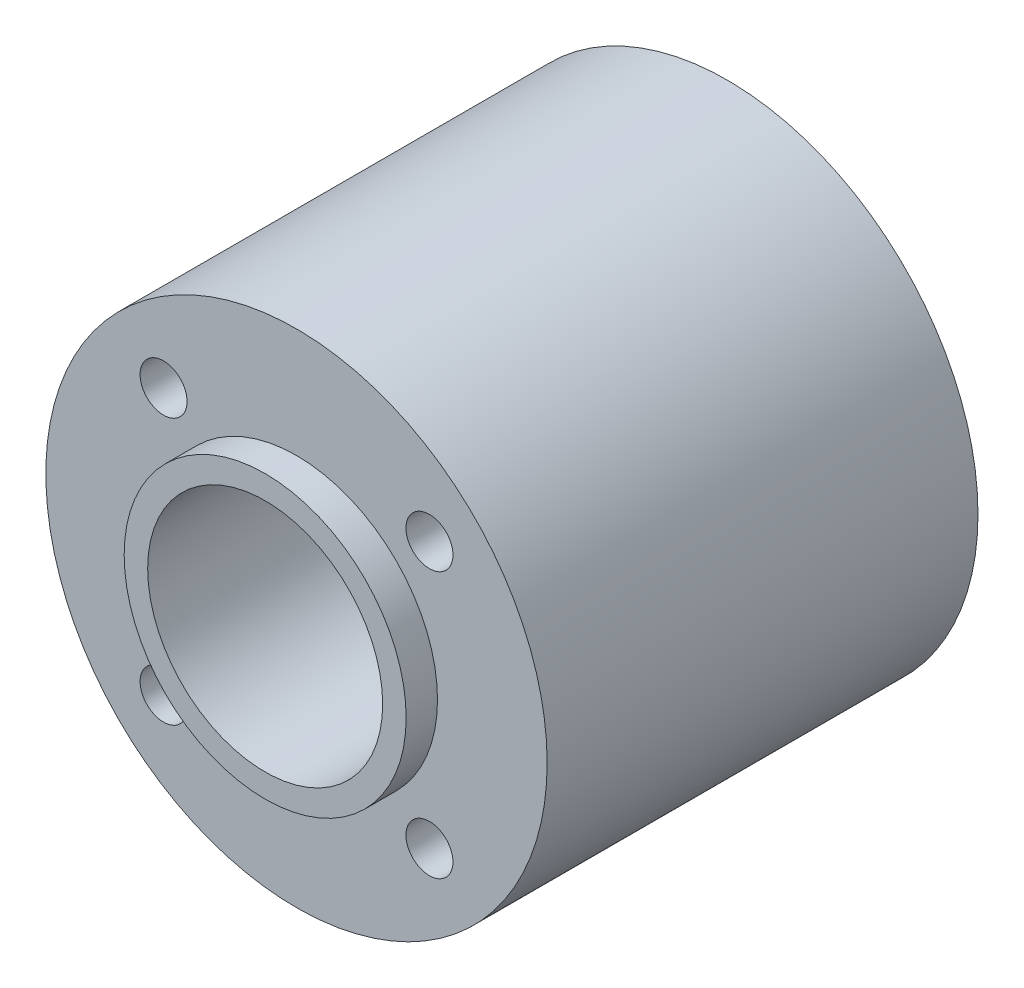
ISO-10303-21;
HEADER;
FILE_DESCRIPTION(('STEP AP214'),'2;1');
FILE_NAME('part.step','',(''),(''),'','','');
FILE_SCHEMA(('AUTOMOTIVE_DESIGN { 1 0 10303 214 1 1 1 1 }'));
ENDSEC;
DATA;
#1=APPLICATION_CONTEXT('core data for automotive mechanical design processes');
#2=APPLICATION_PROTOCOL_DEFINITION('international standard','automotive_design',2000,#1);
#3=PRODUCT_CONTEXT('',#1,'mechanical');
#4=PRODUCT('Part','Part','',(#3));
#5=PRODUCT_RELATED_PRODUCT_CATEGORY('part','',(#4));
#6=PRODUCT_DEFINITION_FORMATION('','',#4);
#7=PRODUCT_DEFINITION_CONTEXT('part definition',#1,'design');
#8=PRODUCT_DEFINITION('design','',#6,#7);
#9=PRODUCT_DEFINITION_SHAPE('','',#8);
#10=(LENGTH_UNIT() NAMED_UNIT(*) SI_UNIT(.MILLI.,.METRE.));
#11=(NAMED_UNIT(*) PLANE_ANGLE_UNIT() SI_UNIT($,.RADIAN.));
#12=(NAMED_UNIT(*) SI_UNIT($,.STERADIAN.) SOLID_ANGLE_UNIT());
#13=UNCERTAINTY_MEASURE_WITH_UNIT(LENGTH_MEASURE(1.E-05),#10,'distance_accuracy_value','');
#14=(GEOMETRIC_REPRESENTATION_CONTEXT(3) GLOBAL_UNCERTAINTY_ASSIGNED_CONTEXT((#13)) GLOBAL_UNIT_ASSIGNED_CONTEXT((#10,
#11,#12)) REPRESENTATION_CONTEXT('',''));
#15=CARTESIAN_POINT('',(0.,0.,0.));
#16=DIRECTION('',(0.,0.,1.));
#17=DIRECTION('',(1.,0.,0.));
#18=AXIS2_PLACEMENT_3D('',#15,#16,#17);
#19=CARTESIAN_POINT('',(0.,0.,-36.67125));
#20=DIRECTION('',(0.,0.,1.));
#21=DIRECTION('',(1.,0.,0.));
#22=AXIS2_PLACEMENT_3D('',#19,#20,#21);
#23=CYLINDRICAL_SURFACE('',#22,26.672);
#24=CARTESIAN_POINT('',(0.,0.,-36.67125));
#25=DIRECTION('',(0.,0.,1.));
#26=DIRECTION('',(1.,0.,0.));
#27=AXIS2_PLACEMENT_3D('',#24,#25,#26);
#28=CIRCLE('',#27,26.672);
#29=CARTESIAN_POINT('',(26.672,0.,-36.67125));
#30=VERTEX_POINT('',#29);
#31=EDGE_CURVE('E11',#30,#30,#28,.T.);
#32=ORIENTED_EDGE('',*,*,#31,.T.);
#33=EDGE_LOOP('',(#32));
#34=FACE_BOUND('',#33,.T.);
#35=CARTESIAN_POINT('',(0.,0.,9.17125));
#36=DIRECTION('',(0.,0.,1.));
#37=DIRECTION('',(1.,0.,0.));
#38=AXIS2_PLACEMENT_3D('',#35,#36,#37);
#39=CIRCLE('',#38,26.672);
#40=CARTESIAN_POINT('',(26.672,0.,9.17125));
#41=VERTEX_POINT('',#40);
#42=EDGE_CURVE('E48',#41,#41,#39,.T.);
#43=ORIENTED_EDGE('',*,*,#42,.F.);
#44=EDGE_LOOP('',(#43));
#45=FACE_BOUND('',#44,.T.);
#46=ADVANCED_FACE('F45',(#34,#45),#23,.T.);
#47=CARTESIAN_POINT('',(0.,0.,-36.67125));
#48=DIRECTION('',(0.,0.,1.));
#49=DIRECTION('',(1.,0.,0.));
#50=AXIS2_PLACEMENT_3D('',#47,#48,#49);
#51=CYLINDRICAL_SURFACE('',#50,12.5025);
#52=CARTESIAN_POINT('',(0.,0.,12.50525));
#53=DIRECTION('',(0.,0.,1.));
#54=DIRECTION('',(1.,0.,0.));
#55=AXIS2_PLACEMENT_3D('',#52,#53,#54);
#56=CIRCLE('',#55,12.5025);
#57=CARTESIAN_POINT('',(12.5025,0.,12.50525));
#58=VERTEX_POINT('',#57);
#59=EDGE_CURVE('E63',#58,#58,#56,.T.);
#60=ORIENTED_EDGE('',*,*,#59,.T.);
#61=EDGE_LOOP('',(#60));
#62=FACE_BOUND('',#61,.T.);
#63=CARTESIAN_POINT('',(0.,0.,-40.00525));
#64=DIRECTION('',(0.,0.,1.));
#65=DIRECTION('',(1.,0.,0.));
#66=AXIS2_PLACEMENT_3D('',#63,#64,#65);
#67=CIRCLE('',#66,12.5025);
#68=CARTESIAN_POINT('',(12.5025,0.,-40.00525));
#69=VERTEX_POINT('',#68);
#70=EDGE_CURVE('E107',#69,#69,#67,.T.);
#71=ORIENTED_EDGE('',*,*,#70,.F.);
#72=EDGE_LOOP('',(#71));
#73=FACE_BOUND('',#72,.T.);
#74=ADVANCED_FACE('F118',(#62,#73),#51,.F.);
#75=CARTESIAN_POINT('',(0.,0.,-36.67125));
#76=DIRECTION('',(0.,0.,1.));
#77=DIRECTION('',(1.,0.,0.));
#78=AXIS2_PLACEMENT_3D('',#75,#76,#77);
#79=PLANE('',#78);
#80=CARTESIAN_POINT('',(0.,0.,-36.67125));
#81=DIRECTION('',(0.,0.,1.));
#82=DIRECTION('',(1.,0.,0.));
#83=AXIS2_PLACEMENT_3D('',#80,#81,#82);
#84=CIRCLE('',#83,15.003);
#85=CARTESIAN_POINT('',(15.003,0.,-36.67125));
#86=VERTEX_POINT('',#85);
#87=EDGE_CURVE('E103',#86,#86,#84,.T.);
#88=ORIENTED_EDGE('',*,*,#87,.T.);
#89=EDGE_LOOP('',(#88));
#90=FACE_BOUND('',#89,.T.);
#91=CARTESIAN_POINT('',(-14.1449640508557,-14.1449640508557,-36.67125));
#92=DIRECTION('',(0.,0.,1.));
#93=DIRECTION('',(1.,0.,0.));
#94=AXIS2_PLACEMENT_3D('',#91,#92,#93);
#95=CIRCLE('',#94,2.50050000000019);
#96=CARTESIAN_POINT('',(-11.6444640508555,-14.1449640508557,-36.67125));
#97=VERTEX_POINT('',#96);
#98=EDGE_CURVE('E64',#97,#97,#95,.T.);
#99=ORIENTED_EDGE('',*,*,#98,.T.);
#100=EDGE_LOOP('',(#99));
#101=FACE_BOUND('',#100,.T.);
#102=CARTESIAN_POINT('',(14.1449640508557,-14.1449640508557,-36.67125));
#103=DIRECTION('',(0.,0.,1.));
#104=DIRECTION('',(1.,0.,0.));
#105=AXIS2_PLACEMENT_3D('',#102,#103,#104);
#106=CIRCLE('',#105,2.50050000000013);
#107=CARTESIAN_POINT('',(16.6454640508558,-14.1449640508557,-36.67125));
#108=VERTEX_POINT('',#107);
#109=EDGE_CURVE('E74',#108,#108,#106,.T.);
#110=ORIENTED_EDGE('',*,*,#109,.T.);
#111=EDGE_LOOP('',(#110));
#112=FACE_BOUND('',#111,.T.);
#113=CARTESIAN_POINT('',(14.1449640508557,14.1449640508557,-36.67125));
#114=DIRECTION('',(0.,0.,1.));
#115=DIRECTION('',(1.,0.,0.));
#116=AXIS2_PLACEMENT_3D('',#113,#114,#115);
#117=CIRCLE('',#116,2.50050000000006);
#118=CARTESIAN_POINT('',(16.6454640508558,14.1449640508557,-36.67125));
#119=VERTEX_POINT('',#118);
#120=EDGE_CURVE('E78',#119,#119,#117,.T.);
#121=ORIENTED_EDGE('',*,*,#120,.T.);
#122=EDGE_LOOP('',(#121));
#123=FACE_BOUND('',#122,.T.);
#124=CARTESIAN_POINT('',(-14.1449640508557,14.1449640508557,-36.67125));
#125=DIRECTION('',(0.,0.,1.));
#126=DIRECTION('',(1.,0.,0.));
#127=AXIS2_PLACEMENT_3D('',#124,#125,#126);
#128=CIRCLE('',#127,2.5005);
#129=CARTESIAN_POINT('',(-11.6444640508557,14.1449640508557,-36.67125));
#130=VERTEX_POINT('',#129);
#131=EDGE_CURVE('E82',#130,#130,#128,.T.);
#132=ORIENTED_EDGE('',*,*,#131,.T.);
#133=EDGE_LOOP('',(#132));
#134=FACE_BOUND('',#133,.T.);
#135=ORIENTED_EDGE('',*,*,#31,.F.);
#136=EDGE_LOOP('',(#135));
#137=FACE_BOUND('',#136,.T.);
#138=ADVANCED_FACE('F120',(#90,#101,#112,#123,#134,#137),#79,.F.);
#139=CARTESIAN_POINT('',(0.,0.,9.17125));
#140=DIRECTION('',(0.,0.,1.));
#141=DIRECTION('',(1.,0.,0.));
#142=AXIS2_PLACEMENT_3D('',#139,#140,#141);
#143=PLANE('',#142);
#144=CARTESIAN_POINT('',(-14.1449640508557,-14.1449640508557,9.17125));
#145=DIRECTION('',(0.,0.,1.));
#146=DIRECTION('',(1.,0.,0.));
#147=AXIS2_PLACEMENT_3D('',#144,#145,#146);
#148=CIRCLE('',#147,2.50050000000019);
#149=CARTESIAN_POINT('',(-11.6444640508555,-14.1449640508557,9.17125));
#150=VERTEX_POINT('',#149);
#151=EDGE_CURVE('E91',#150,#150,#148,.T.);
#152=ORIENTED_EDGE('',*,*,#151,.F.);
#153=EDGE_LOOP('',(#152));
#154=FACE_BOUND('',#153,.T.);
#155=CARTESIAN_POINT('',(14.1449640508557,-14.1449640508557,9.17125));
#156=DIRECTION('',(0.,0.,1.));
#157=DIRECTION('',(1.,0.,0.));
#158=AXIS2_PLACEMENT_3D('',#155,#156,#157);
#159=CIRCLE('',#158,2.50050000000013);
#160=CARTESIAN_POINT('',(16.6454640508558,-14.1449640508557,9.17125));
#161=VERTEX_POINT('',#160);
#162=EDGE_CURVE('E95',#161,#161,#159,.T.);
#163=ORIENTED_EDGE('',*,*,#162,.F.);
#164=EDGE_LOOP('',(#163));
#165=FACE_BOUND('',#164,.T.);
#166=CARTESIAN_POINT('',(14.1449640508557,14.1449640508557,9.17125));
#167=DIRECTION('',(0.,0.,1.));
#168=DIRECTION('',(1.,0.,0.));
#169=AXIS2_PLACEMENT_3D('',#166,#167,#168);
#170=CIRCLE('',#169,2.50050000000006);
#171=CARTESIAN_POINT('',(16.6454640508558,14.1449640508557,9.17125));
#172=VERTEX_POINT('',#171);
#173=EDGE_CURVE('E90',#172,#172,#170,.T.);
#174=ORIENTED_EDGE('',*,*,#173,.F.);
#175=EDGE_LOOP('',(#174));
#176=FACE_BOUND('',#175,.T.);
#177=CARTESIAN_POINT('',(-14.1449640508557,14.1449640508557,9.17125));
#178=DIRECTION('',(0.,0.,1.));
#179=DIRECTION('',(1.,0.,0.));
#180=AXIS2_PLACEMENT_3D('',#177,#178,#179);
#181=CIRCLE('',#180,2.5005);
#182=CARTESIAN_POINT('',(-11.6444640508557,14.1449640508557,9.17125));
#183=VERTEX_POINT('',#182);
#184=EDGE_CURVE('E86',#183,#183,#181,.T.);
#185=ORIENTED_EDGE('',*,*,#184,.F.);
#186=EDGE_LOOP('',(#185));
#187=FACE_BOUND('',#186,.T.);
#188=CARTESIAN_POINT('',(0.,0.,9.17125));
#189=DIRECTION('',(0.,0.,1.));
#190=DIRECTION('',(1.,0.,0.));
#191=AXIS2_PLACEMENT_3D('',#188,#189,#190);
#192=CIRCLE('',#191,15.003);
#193=CARTESIAN_POINT('',(15.003,0.,9.17125));
#194=VERTEX_POINT('',#193);
#195=EDGE_CURVE('E59',#194,#194,#192,.T.);
#196=ORIENTED_EDGE('',*,*,#195,.F.);
#197=EDGE_LOOP('',(#196));
#198=FACE_BOUND('',#197,.T.);
#199=ORIENTED_EDGE('',*,*,#42,.T.);
#200=EDGE_LOOP('',(#199));
#201=FACE_BOUND('',#200,.T.);
#202=ADVANCED_FACE('F126',(#154,#165,#176,#187,#198,#201),#143,.T.);
#203=CARTESIAN_POINT('',(0.,0.,12.50525));
#204=DIRECTION('',(0.,0.,-1.));
#205=DIRECTION('',(-1.,0.,0.));
#206=AXIS2_PLACEMENT_3D('',#203,#204,#205);
#207=CYLINDRICAL_SURFACE('',#206,15.003);
#208=CARTESIAN_POINT('',(0.,0.,12.50525));
#209=DIRECTION('',(0.,0.,1.));
#210=DIRECTION('',(1.,0.,0.));
#211=AXIS2_PLACEMENT_3D('',#208,#209,#210);
#212=CIRCLE('',#211,15.003);
#213=CARTESIAN_POINT('',(15.003,0.,12.50525));
#214=VERTEX_POINT('',#213);
#215=EDGE_CURVE('E57',#214,#214,#212,.T.);
#216=ORIENTED_EDGE('',*,*,#215,.F.);
#217=EDGE_LOOP('',(#216));
#218=FACE_BOUND('',#217,.T.);
#219=ORIENTED_EDGE('',*,*,#195,.T.);
#220=EDGE_LOOP('',(#219));
#221=FACE_BOUND('',#220,.T.);
#222=ADVANCED_FACE('F131',(#218,#221),#207,.T.);
#223=CARTESIAN_POINT('',(0.,0.,12.50525));
#224=DIRECTION('',(0.,0.,1.));
#225=DIRECTION('',(1.,0.,0.));
#226=AXIS2_PLACEMENT_3D('',#223,#224,#225);
#227=PLANE('',#226);
#228=ORIENTED_EDGE('',*,*,#59,.F.);
#229=EDGE_LOOP('',(#228));
#230=FACE_BOUND('',#229,.T.);
#231=ORIENTED_EDGE('',*,*,#215,.T.);
#232=EDGE_LOOP('',(#231));
#233=FACE_BOUND('',#232,.T.);
#234=ADVANCED_FACE('F136',(#230,#233),#227,.T.);
#235=CARTESIAN_POINT('',(-14.1449640508557,14.1449640508557,-69.17775));
#236=DIRECTION('',(0.,0.,1.));
#237=DIRECTION('',(1.,0.,0.));
#238=AXIS2_PLACEMENT_3D('',#235,#236,#237);
#239=CYLINDRICAL_SURFACE('',#238,2.5005);
#240=ORIENTED_EDGE('',*,*,#184,.T.);
#241=EDGE_LOOP('',(#240));
#242=FACE_BOUND('',#241,.T.);
#243=ORIENTED_EDGE('',*,*,#131,.F.);
#244=EDGE_LOOP('',(#243));
#245=FACE_BOUND('',#244,.T.);
#246=ADVANCED_FACE('F140',(#242,#245),#239,.F.);
#247=CARTESIAN_POINT('',(14.1449640508557,14.1449640508557,-69.17775));
#248=DIRECTION('',(0.,0.,1.));
#249=DIRECTION('',(1.,0.,0.));
#250=AXIS2_PLACEMENT_3D('',#247,#248,#249);
#251=CYLINDRICAL_SURFACE('',#250,2.50050000000006);
#252=ORIENTED_EDGE('',*,*,#173,.T.);
#253=EDGE_LOOP('',(#252));
#254=FACE_BOUND('',#253,.T.);
#255=ORIENTED_EDGE('',*,*,#120,.F.);
#256=EDGE_LOOP('',(#255));
#257=FACE_BOUND('',#256,.T.);
#258=ADVANCED_FACE('F144',(#254,#257),#251,.F.);
#259=CARTESIAN_POINT('',(14.1449640508557,-14.1449640508557,-69.17775));
#260=DIRECTION('',(0.,0.,1.));
#261=DIRECTION('',(1.,0.,0.));
#262=AXIS2_PLACEMENT_3D('',#259,#260,#261);
#263=CYLINDRICAL_SURFACE('',#262,2.50050000000013);
#264=ORIENTED_EDGE('',*,*,#162,.T.);
#265=EDGE_LOOP('',(#264));
#266=FACE_BOUND('',#265,.T.);
#267=ORIENTED_EDGE('',*,*,#109,.F.);
#268=EDGE_LOOP('',(#267));
#269=FACE_BOUND('',#268,.T.);
#270=ADVANCED_FACE('F150',(#266,#269),#263,.F.);
#271=CARTESIAN_POINT('',(-14.1449640508557,-14.1449640508557,-69.17775));
#272=DIRECTION('',(0.,0.,1.));
#273=DIRECTION('',(1.,0.,0.));
#274=AXIS2_PLACEMENT_3D('',#271,#272,#273);
#275=CYLINDRICAL_SURFACE('',#274,2.50050000000019);
#276=ORIENTED_EDGE('',*,*,#151,.T.);
#277=EDGE_LOOP('',(#276));
#278=FACE_BOUND('',#277,.T.);
#279=ORIENTED_EDGE('',*,*,#98,.F.);
#280=EDGE_LOOP('',(#279));
#281=FACE_BOUND('',#280,.T.);
#282=ADVANCED_FACE('F146',(#278,#281),#275,.F.);
#283=CARTESIAN_POINT('',(0.,0.,-40.00525));
#284=DIRECTION('',(0.,0.,1.));
#285=DIRECTION('',(1.,0.,0.));
#286=AXIS2_PLACEMENT_3D('',#283,#284,#285);
#287=CYLINDRICAL_SURFACE('',#286,15.003);
#288=CARTESIAN_POINT('',(0.,0.,-40.00525));
#289=DIRECTION('',(0.,0.,1.));
#290=DIRECTION('',(1.,0.,0.));
#291=AXIS2_PLACEMENT_3D('',#288,#289,#290);
#292=CIRCLE('',#291,15.003);
#293=CARTESIAN_POINT('',(15.003,0.,-40.00525));
#294=VERTEX_POINT('',#293);
#295=EDGE_CURVE('E96',#294,#294,#292,.T.);
#296=ORIENTED_EDGE('',*,*,#295,.T.);
#297=EDGE_LOOP('',(#296));
#298=FACE_BOUND('',#297,.T.);
#299=ORIENTED_EDGE('',*,*,#87,.F.);
#300=EDGE_LOOP('',(#299));
#301=FACE_BOUND('',#300,.T.);
#302=ADVANCED_FACE('F149',(#298,#301),#287,.T.);
#303=CARTESIAN_POINT('',(0.,0.,-40.00525));
#304=DIRECTION('',(0.,0.,1.));
#305=DIRECTION('',(1.,0.,0.));
#306=AXIS2_PLACEMENT_3D('',#303,#304,#305);
#307=PLANE('',#306);
#308=ORIENTED_EDGE('',*,*,#70,.T.);
#309=EDGE_LOOP('',(#308));
#310=FACE_BOUND('',#309,.T.);
#311=ORIENTED_EDGE('',*,*,#295,.F.);
#312=EDGE_LOOP('',(#311));
#313=FACE_BOUND('',#312,.T.);
#314=ADVANCED_FACE('F115',(#310,#313),#307,.F.);
#315=CLOSED_SHELL('',(#46,#74,#138,#202,#222,#234,#246,#258,#270,#282,#302,#314));
#316=MANIFOLD_SOLID_BREP('B2',#315);
#317=ADVANCED_BREP_SHAPE_REPRESENTATION('',(#18,#316),#14);
#318=SHAPE_DEFINITION_REPRESENTATION(#9,#317);
ENDSEC;
END-ISO-10303-21;
